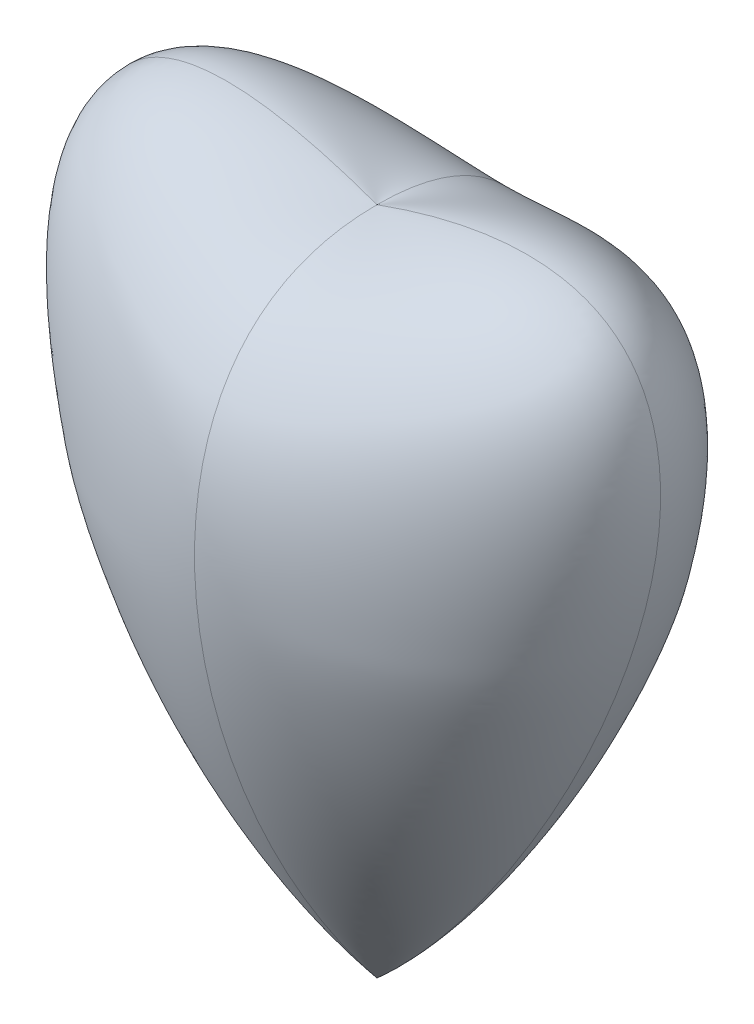
ISO-10303-21;
HEADER;
FILE_DESCRIPTION(('STEP AP214'),'2;1');
FILE_NAME('part.step','',(''),(''),'','','');
FILE_SCHEMA(('AUTOMOTIVE_DESIGN { 1 0 10303 214 1 1 1 1 }'));
ENDSEC;
DATA;
#1=APPLICATION_CONTEXT('core data for automotive mechanical design processes');
#2=APPLICATION_PROTOCOL_DEFINITION('international standard','automotive_design',2000,#1);
#3=PRODUCT_CONTEXT('',#1,'mechanical');
#4=PRODUCT('Part','Part','',(#3));
#5=PRODUCT_RELATED_PRODUCT_CATEGORY('part','',(#4));
#6=PRODUCT_DEFINITION_FORMATION('','',#4);
#7=PRODUCT_DEFINITION_CONTEXT('part definition',#1,'design');
#8=PRODUCT_DEFINITION('design','',#6,#7);
#9=PRODUCT_DEFINITION_SHAPE('','',#8);
#10=(LENGTH_UNIT() NAMED_UNIT(*) SI_UNIT(.MILLI.,.METRE.));
#11=(NAMED_UNIT(*) PLANE_ANGLE_UNIT() SI_UNIT($,.RADIAN.));
#12=(NAMED_UNIT(*) SI_UNIT($,.STERADIAN.) SOLID_ANGLE_UNIT());
#13=UNCERTAINTY_MEASURE_WITH_UNIT(LENGTH_MEASURE(1.E-05),#10,'distance_accuracy_value','');
#14=(GEOMETRIC_REPRESENTATION_CONTEXT(3) GLOBAL_UNCERTAINTY_ASSIGNED_CONTEXT((#13)) GLOBAL_UNIT_ASSIGNED_CONTEXT((#10,
#11,#12)) REPRESENTATION_CONTEXT('',''));
#15=CARTESIAN_POINT('',(0.,0.,0.));
#16=DIRECTION('',(0.,0.,1.));
#17=DIRECTION('',(1.,0.,0.));
#18=AXIS2_PLACEMENT_3D('',#15,#16,#17);
#19=CARTESIAN_POINT('',(0.,-46.6213268032057,0.));
#20=CARTESIAN_POINT('',(0.,-46.6213268032057,0.));
#21=CARTESIAN_POINT('',(0.,-46.6213268032057,0.));
#22=CARTESIAN_POINT('',(0.,-46.6213268032057,0.));
#23=CARTESIAN_POINT('',(1.13051228827783,-45.6225779628254,0.));
#24=CARTESIAN_POINT('',(1.13051228827783,-45.6225779628254,0.445300611491787));
#25=CARTESIAN_POINT('',(0.445300611491787,-45.6739537178196,0.759127937524415));
#26=CARTESIAN_POINT('',(0.,-45.6739537178196,0.759127937524415));
#27=CARTESIAN_POINT('',(3.28623084838856,-43.5741127770957,0.));
#28=CARTESIAN_POINT('',(3.28623084838856,-43.5741127770957,1.34262849043695));
#29=CARTESIAN_POINT('',(1.34685428148095,-43.7322109616794,2.26765167337983));
#30=CARTESIAN_POINT('',(0.,-43.7322109616794,2.26765167337983));
#31=CARTESIAN_POINT('',(7.26857467412762,-39.3532222788361,0.));
#32=CARTESIAN_POINT('',(7.26857467412762,-39.3532222788361,3.02819689009236));
#33=CARTESIAN_POINT('',(3.05566453187834,-39.6686813992152,5.23136881524727));
#34=CARTESIAN_POINT('',(0.,-39.6686813992152,5.23136881524727));
#35=CARTESIAN_POINT('',(11.7602720992127,-33.9273230291898,0.));
#36=CARTESIAN_POINT('',(11.7602720992127,-33.9273230291898,5.02722208234695));
#37=CARTESIAN_POINT('',(5.10751211218288,-34.2665786482051,8.80901754961998));
#38=CARTESIAN_POINT('',(0.,-34.2665786482051,8.80901754961998));
#39=CARTESIAN_POINT('',(16.6080014395491,-27.2559865047789,0.));
#40=CARTESIAN_POINT('',(16.6080014395491,-27.2559865047789,7.26031911611085));
#41=CARTESIAN_POINT('',(7.42935075787071,-27.3154038180331,12.8125890837119));
#42=CARTESIAN_POINT('',(0.,-27.3154038180331,12.8125890837119));
#43=CARTESIAN_POINT('',(21.0407136372392,-20.4165369106544,0.));
#44=CARTESIAN_POINT('',(21.0407136372392,-20.4165369106544,9.32830134519519));
#45=CARTESIAN_POINT('',(9.59875197201096,-20.0165363483266,16.4228537572866));
#46=CARTESIAN_POINT('',(0.,-20.0165363483266,16.4228537572866));
#47=CARTESIAN_POINT('',(25.1325041453014,-13.3682859505047,0.));
#48=CARTESIAN_POINT('',(25.1325041453014,-13.3682859505047,11.2065944436326));
#49=CARTESIAN_POINT('',(11.5784640555043,-12.490935128511,19.536111656982));
#50=CARTESIAN_POINT('',(0.,-12.490935128511,19.536111656982));
#51=CARTESIAN_POINT('',(28.918824266872,-6.04281742376062,0.));
#52=CARTESIAN_POINT('',(28.918824266872,-6.04281742376062,12.8662587595553));
#53=CARTESIAN_POINT('',(13.3268699833509,-4.88202235903342,22.0747674831028));
#54=CARTESIAN_POINT('',(0.,-4.88202235903342,22.0747674831028));
#55=CARTESIAN_POINT('',(32.3967898696893,1.6585988547866,0.));
#56=CARTESIAN_POINT('',(32.3967898696893,1.6585988547866,14.2688049747289));
#57=CARTESIAN_POINT('',(14.7928030641844,2.66677975965915,23.9612259359541));
#58=CARTESIAN_POINT('',(0.,2.66677975965915,23.961225935954));
#59=CARTESIAN_POINT('',(34.4767021348691,7.1376434806994,0.));
#60=CARTESIAN_POINT('',(34.4729323001451,7.12632652432667,15.1620250218121));
#61=CARTESIAN_POINT('',(15.7028164113161,7.57180365629506,24.7447792845832));
#62=CARTESIAN_POINT('',(0.,7.58651434532157,24.7463948138781));
#63=CARTESIAN_POINT('',(35.8865107391704,11.369856105553,0.));
#64=CARTESIAN_POINT('',(35.8859119851968,11.3680586599363,15.3912840861341));
#65=CARTESIAN_POINT('',(15.932032726006,11.1527807319344,25.1380421304358));
#66=CARTESIAN_POINT('',(0.,11.1551118235425,25.1382981316667));
#67=CARTESIAN_POINT('',(36.7563451676475,14.1597012970804,0.));
#68=CARTESIAN_POINT('',(36.7563451676475,14.1597012970804,15.3269022384799));
#69=CARTESIAN_POINT('',(15.8635777010674,13.4318837718768,25.3326385445471));
#70=CARTESIAN_POINT('',(0.,13.4318837718768,25.3326385445471));
#71=CARTESIAN_POINT('',(37.8915626574449,18.4934691596049,0.));
#72=CARTESIAN_POINT('',(37.8915626574449,18.4934691596049,15.352054351209));
#73=CARTESIAN_POINT('',(15.8712984257401,16.7607770834714,25.441907716394));
#74=CARTESIAN_POINT('',(0.,16.7607770834714,25.441907716394));
#75=CARTESIAN_POINT('',(38.7996730624471,22.9715185475658,0.));
#76=CARTESIAN_POINT('',(38.7996730624471,22.9715185475658,15.368815432418));
#77=CARTESIAN_POINT('',(15.8611200890436,20.0174962702014,25.364798926273));
#78=CARTESIAN_POINT('',(0.,20.0174962702014,25.364798926273));
#79=CARTESIAN_POINT('',(39.4007405496589,27.5811529142721,0.));
#80=CARTESIAN_POINT('',(39.4007405496589,27.5811529142721,15.3491424267882));
#81=CARTESIAN_POINT('',(15.8065843073008,23.2032737512452,25.0854861494432));
#82=CARTESIAN_POINT('',(0.,23.2032737512452,25.0854861494432));
#83=CARTESIAN_POINT('',(39.5748859108984,32.2959609266022,0.));
#84=CARTESIAN_POINT('',(39.5748859108984,32.2959609266022,15.2540245075061));
#85=CARTESIAN_POINT('',(15.6702649253398,26.3193419457811,24.5881433611637));
#86=CARTESIAN_POINT('',(0.,26.3193419457811,24.5881433611637));
#87=CARTESIAN_POINT('',(39.1445568883385,37.0518589042345,0.));
#88=CARTESIAN_POINT('',(39.1445568883385,37.0518589042345,15.0254004740772));
#89=CARTESIAN_POINT('',(15.3956854143074,29.3517776528513,23.8452139460691));
#90=CARTESIAN_POINT('',(0.,29.3517776528513,23.8452139460691));
#91=CARTESIAN_POINT('',(38.0538675540167,40.924815303396,0.));
#92=CARTESIAN_POINT('',(38.0538675540167,40.924815303396,14.6489029680226));
#93=CARTESIAN_POINT('',(14.978250557514,31.7975110017232,22.9984867316731));
#94=CARTESIAN_POINT('',(0.,31.7975110017232,22.9984867316731));
#95=CARTESIAN_POINT('',(36.579037312096,43.7860812422909,0.));
#96=CARTESIAN_POINT('',(36.579037312096,43.7860812422909,14.1751160450414));
#97=CARTESIAN_POINT('',(14.4709214181212,33.6848624301592,22.1687820601869));
#98=CARTESIAN_POINT('',(0.,33.6848624301592,22.1687820601869));
#99=CARTESIAN_POINT('',(35.1509853813602,45.73385414719,0.));
#100=CARTESIAN_POINT('',(35.1509853813602,45.73385414719,13.7200020043031));
#101=CARTESIAN_POINT('',(13.9904526311189,35.0606440245429,21.4664042868678));
#102=CARTESIAN_POINT('',(0.,35.0606440245429,21.4664042868678));
#103=CARTESIAN_POINT('',(33.4099304398918,47.4117757064586,0.));
#104=CARTESIAN_POINT('',(33.4099304398918,47.4117757064586,13.159218638388));
#105=CARTESIAN_POINT('',(13.4043145189398,36.3915792903708,20.6799894241243));
#106=CARTESIAN_POINT('',(0.,36.3915792903708,20.6799894241243));
#107=CARTESIAN_POINT('',(31.4084561208772,48.7617276088435,0.));
#108=CARTESIAN_POINT('',(31.4084561208772,48.7617276088435,12.4993891955368));
#109=CARTESIAN_POINT('',(12.7193284137798,37.66948180394,19.8076121886582));
#110=CARTESIAN_POINT('',(0.,37.66948180394,19.8076121886582));
#111=CARTESIAN_POINT('',(29.2223694537122,49.7720483488829,0.));
#112=CARTESIAN_POINT('',(29.2223694537122,49.7720483488829,11.7570826935748));
#113=CARTESIAN_POINT('',(11.9522614174194,38.8861651415474,18.8473472971709));
#114=CARTESIAN_POINT('',(0.,38.8861651415474,18.8473472971709));
#115=CARTESIAN_POINT('',(26.9251259176925,50.465363387162,0.));
#116=CARTESIAN_POINT('',(26.9251259176925,50.465363387162,10.9521674747066));
#117=CARTESIAN_POINT('',(11.1231799560183,40.0329496565182,17.7996458920486));
#118=CARTESIAN_POINT('',(0.,40.0329496565182,17.7996458920486));
#119=CARTESIAN_POINT('',(24.5735752192804,50.8855809181493,0.));
#120=CARTESIAN_POINT('',(24.5735752192804,50.8855809181493,10.1027219238561));
#121=CARTESIAN_POINT('',(10.2503604984557,41.1011557021776,16.6649591156769));
#122=CARTESIAN_POINT('',(0.,41.1011557021776,16.6649591156769));
#123=CARTESIAN_POINT('',(21.4135208527332,51.1399537433875,0.));
#124=CARTESIAN_POINT('',(21.4135208527332,51.1399537433875,8.92857906078101));
#125=CARTESIAN_POINT('',(9.04637298613242,42.412408503355,15.041445672229));
#126=CARTESIAN_POINT('',(0.,42.412408503355,15.041445672229));
#127=CARTESIAN_POINT('',(17.481898288781,50.9930857074177,0.));
#128=CARTESIAN_POINT('',(17.481898288781,50.9930857074177,7.41066442694201));
#129=CARTESIAN_POINT('',(7.49412380006094,43.8240884542237,12.8147757649711));
#130=CARTESIAN_POINT('',(0.,43.8240884542237,12.8147757649711));
#131=CARTESIAN_POINT('',(12.8814270936918,50.3195650057034,0.));
#132=CARTESIAN_POINT('',(12.8814270936918,50.3195650057034,5.56064358702089));
#133=CARTESIAN_POINT('',(5.60924018402686,45.1113405998043,9.88184687534541));
#134=CARTESIAN_POINT('',(0.,45.1113405998043,9.88184687534541));
#135=CARTESIAN_POINT('',(8.42562762291368,49.3058744139121,0.));
#136=CARTESIAN_POINT('',(8.42562762291368,49.3058744139121,3.70437901848294));
#137=CARTESIAN_POINT('',(3.72603619758343,46.0041400273576,6.74161412407392));
#138=CARTESIAN_POINT('',(0.,46.0041400273576,6.74161412407392));
#139=CARTESIAN_POINT('',(4.12350774377605,48.0560797063807,0.));
#140=CARTESIAN_POINT('',(4.12350774377605,48.0560797063807,1.85041964695783));
#141=CARTESIAN_POINT('',(1.85464543800183,46.5147978143178,3.44769865042711));
#142=CARTESIAN_POINT('',(0.,46.5147978143178,3.44769865042711));
#143=CARTESIAN_POINT('',(1.35776800822028,47.1124458616088,0.));
#144=CARTESIAN_POINT('',(1.35776800822028,47.1124458616088,0.620750878771898));
#145=CARTESIAN_POINT('',(0.620750878771897,46.6213268032057,1.1620565194078));
#146=CARTESIAN_POINT('',(0.,46.6213268032057,1.1620565194078));
#147=CARTESIAN_POINT('',(0.,46.6213268032057,0.));
#148=CARTESIAN_POINT('',(0.,46.6213268032057,0.));
#149=CARTESIAN_POINT('',(0.,46.6213268032057,0.));
#150=CARTESIAN_POINT('',(0.,46.6213268032057,0.));
#151=B_SPLINE_SURFACE_WITH_KNOTS('',3,3,((#19,#20,#21,#22),(#23,#24,#25,#26),(#27,#28,#29,#30),
(#31,#32,#33,#34),(#35,#36,#37,#38),(#39,#40,#41,#42),(#43,#44,#45,#46),(#47,#48,#49,#50),(#51,
#52,#53,#54),(#55,#56,#57,#58),(#59,#60,#61,#62),(#63,#64,#65,#66),(#67,#68,#69,#70),(#71,#72,
#73,#74),(#75,#76,#77,#78),(#79,#80,#81,#82),(#83,#84,#85,#86),(#87,#88,#89,#90),(#91,#92,#93,
#94),(#95,#96,#97,#98),(#99,#100,#101,#102),(#103,#104,#105,#106),(#107,#108,#109,#110),(#111,
#112,#113,#114),(#115,#116,#117,#118),(#119,#120,#121,#122),(#123,#124,#125,#126),(#127,#128,
#129,#130),(#131,#132,#133,#134),(#135,#136,#137,#138),(#139,#140,#141,#142),(#143,#144,#145,
#146),(#147,#148,#149,#150)),.UNSPECIFIED.,.F.,.F.,.F.,(4,1,1,1,1,1,1,1,1,2,1,1,1,1,1,1,1,1,1,1,
1,1,1,1,1,1,1,1,1,4),(4,4),(0.,0.0319331403142546,0.0638662806285092,0.127732561257018,
0.191598841885528,0.255465122514037,0.319331403142546,0.383197683771055,0.447063964399565,
0.510930245028074,0.541497104713819,0.572063964399564,0.60263082408531,0.633197683771055,
0.663764543456801,0.694331403142546,0.724898262828291,0.740181692671164,0.755465122514037,
0.77074855235691,0.786031982199782,0.801315412042655,0.816598841885528,0.8318822717284,
0.847165701571273,0.877732561257018,0.908299420942764,0.938866280628509,0.969433140314255,1.),
(0.,1.),.UNSPECIFIED.);
#152=CARTESIAN_POINT('',(0.,-46.6213268032057,0.));
#153=CARTESIAN_POINT('',(31.3377814309968,-18.9360259101238,0.));
#154=CARTESIAN_POINT('',(70.446601168176,72.1026080117432,0.));
#155=CARTESIAN_POINT('',(0.,46.6213268032057,0.));
#156=B_SPLINE_CURVE_WITH_KNOTS('',3,(#152,#153,#154,#155),.UNSPECIFIED.,.F.,.F.,(4,4),(0.,1.),.UNSPECIFIED.);
#157=CARTESIAN_POINT('',(0.,-46.6213268032057,0.));
#158=VERTEX_POINT('',#157);
#159=CARTESIAN_POINT('',(0.,46.6213268032057,0.));
#160=VERTEX_POINT('',#159);
#161=EDGE_CURVE('E91',#158,#160,#156,.T.);
#162=CARTESIAN_POINT('',(0.,46.6213268032057,0.));
#163=CARTESIAN_POINT('',(0.,46.6213268032057,37.3767464824983));
#164=CARTESIAN_POINT('',(0.,-8.93486853865014,30.1980748411409));
#165=CARTESIAN_POINT('',(0.,-46.6213268032057,0.));
#166=B_SPLINE_CURVE_WITH_KNOTS('',3,(#162,#163,#164,#165),.UNSPECIFIED.,.F.,.F.,(4,4),(0.,1.),.UNSPECIFIED.);
#167=EDGE_CURVE('E13',#160,#158,#166,.T.);
#168=ORIENTED_EDGE('',*,*,#161,.T.);
#169=ORIENTED_EDGE('',*,*,#167,.T.);
#170=EDGE_LOOP('',(#168,#169));
#171=FACE_BOUND('',#170,.T.);
#172=ADVANCED_FACE('F85',(#171),#151,.T.);
#173=CARTESIAN_POINT('',(0.,-46.6213268032057,0.));
#174=CARTESIAN_POINT('',(0.,-46.6213268032057,0.));
#175=CARTESIAN_POINT('',(0.,-46.6213268032057,0.));
#176=CARTESIAN_POINT('',(0.,-46.6213268032057,0.));
#177=CARTESIAN_POINT('',(-1.13051228827783,-45.6225779628254,0.));
#178=CARTESIAN_POINT('',(-1.13051228827783,-45.6225779628254,0.445300611491787));
#179=CARTESIAN_POINT('',(-0.445300611491787,-45.6739537178196,0.759127937524415));
#180=CARTESIAN_POINT('',(0.,-45.6739537178196,0.759127937524415));
#181=CARTESIAN_POINT('',(-3.28623084838856,-43.5741127770957,0.));
#182=CARTESIAN_POINT('',(-3.28623084838856,-43.5741127770957,1.34262849043695));
#183=CARTESIAN_POINT('',(-1.34685428148095,-43.7322109616794,2.26765167337983));
#184=CARTESIAN_POINT('',(0.,-43.7322109616794,2.26765167337983));
#185=CARTESIAN_POINT('',(-7.26857467412762,-39.3532222788361,0.));
#186=CARTESIAN_POINT('',(-7.26857467412762,-39.3532222788361,3.02819689009236));
#187=CARTESIAN_POINT('',(-3.05566453187834,-39.6686813992152,5.23136881524727));
#188=CARTESIAN_POINT('',(0.,-39.6686813992152,5.23136881524727));
#189=CARTESIAN_POINT('',(-11.7602720992127,-33.9273230291898,0.));
#190=CARTESIAN_POINT('',(-11.7602720992127,-33.9273230291898,5.02722208234695));
#191=CARTESIAN_POINT('',(-5.10751211218288,-34.2665786482051,8.80901754961998));
#192=CARTESIAN_POINT('',(0.,-34.2665786482051,8.80901754961998));
#193=CARTESIAN_POINT('',(-16.6080014395491,-27.2559865047789,0.));
#194=CARTESIAN_POINT('',(-16.6080014395491,-27.2559865047789,7.26031911611085));
#195=CARTESIAN_POINT('',(-7.42935075787071,-27.3154038180331,12.8125890837119));
#196=CARTESIAN_POINT('',(0.,-27.3154038180331,12.8125890837119));
#197=CARTESIAN_POINT('',(-21.0407136372392,-20.4165369106544,0.));
#198=CARTESIAN_POINT('',(-21.0407136372392,-20.4165369106544,9.32830134519519));
#199=CARTESIAN_POINT('',(-9.59875197201096,-20.0165363483266,16.4228537572866));
#200=CARTESIAN_POINT('',(0.,-20.0165363483266,16.4228537572866));
#201=CARTESIAN_POINT('',(-25.1325041453014,-13.3682859505047,0.));
#202=CARTESIAN_POINT('',(-25.1325041453014,-13.3682859505047,11.2065944436326));
#203=CARTESIAN_POINT('',(-11.5784640555043,-12.490935128511,19.536111656982));
#204=CARTESIAN_POINT('',(0.,-12.490935128511,19.536111656982));
#205=CARTESIAN_POINT('',(-28.918824266872,-6.04281742376062,0.));
#206=CARTESIAN_POINT('',(-28.918824266872,-6.04281742376062,12.8662587595553));
#207=CARTESIAN_POINT('',(-13.3268699833509,-4.88202235903342,22.0747674831028));
#208=CARTESIAN_POINT('',(0.,-4.88202235903342,22.0747674831028));
#209=CARTESIAN_POINT('',(-32.3967898696893,1.6585988547866,0.));
#210=CARTESIAN_POINT('',(-32.3967898696893,1.6585988547866,14.2688049747289));
#211=CARTESIAN_POINT('',(-14.7928030641844,2.66677975965915,23.9612259359541));
#212=CARTESIAN_POINT('',(0.,2.66677975965915,23.961225935954));
#213=CARTESIAN_POINT('',(-34.4767021348691,7.1376434806994,0.));
#214=CARTESIAN_POINT('',(-34.4729323001451,7.12632652432667,15.1620250218121));
#215=CARTESIAN_POINT('',(-15.7028164113161,7.57180365629506,24.7447792845832));
#216=CARTESIAN_POINT('',(0.,7.58651434532157,24.7463948138781));
#217=CARTESIAN_POINT('',(-35.8865107391704,11.369856105553,0.));
#218=CARTESIAN_POINT('',(-35.8859119851968,11.3680586599363,15.3912840861341));
#219=CARTESIAN_POINT('',(-15.932032726006,11.1527807319344,25.1380421304358));
#220=CARTESIAN_POINT('',(0.,11.1551118235425,25.1382981316667));
#221=CARTESIAN_POINT('',(-36.7563451676475,14.1597012970804,0.));
#222=CARTESIAN_POINT('',(-36.7563451676475,14.1597012970804,15.3269022384799));
#223=CARTESIAN_POINT('',(-15.8635777010674,13.4318837718768,25.3326385445471));
#224=CARTESIAN_POINT('',(0.,13.4318837718768,25.3326385445471));
#225=CARTESIAN_POINT('',(-37.8915626574449,18.4934691596049,0.));
#226=CARTESIAN_POINT('',(-37.8915626574449,18.4934691596049,15.352054351209));
#227=CARTESIAN_POINT('',(-15.8712984257401,16.7607770834714,25.441907716394));
#228=CARTESIAN_POINT('',(0.,16.7607770834714,25.441907716394));
#229=CARTESIAN_POINT('',(-38.7996730624471,22.9715185475658,0.));
#230=CARTESIAN_POINT('',(-38.7996730624471,22.9715185475658,15.368815432418));
#231=CARTESIAN_POINT('',(-15.8611200890436,20.0174962702014,25.364798926273));
#232=CARTESIAN_POINT('',(0.,20.0174962702014,25.364798926273));
#233=CARTESIAN_POINT('',(-39.4007405496589,27.5811529142721,0.));
#234=CARTESIAN_POINT('',(-39.4007405496589,27.5811529142721,15.3491424267882));
#235=CARTESIAN_POINT('',(-15.8065843073008,23.2032737512452,25.0854861494432));
#236=CARTESIAN_POINT('',(0.,23.2032737512452,25.0854861494432));
#237=CARTESIAN_POINT('',(-39.5748859108984,32.2959609266022,0.));
#238=CARTESIAN_POINT('',(-39.5748859108984,32.2959609266022,15.2540245075061));
#239=CARTESIAN_POINT('',(-15.6702649253398,26.3193419457811,24.5881433611637));
#240=CARTESIAN_POINT('',(0.,26.3193419457811,24.5881433611637));
#241=CARTESIAN_POINT('',(-39.1445568883385,37.0518589042345,0.));
#242=CARTESIAN_POINT('',(-39.1445568883385,37.0518589042345,15.0254004740772));
#243=CARTESIAN_POINT('',(-15.3956854143074,29.3517776528513,23.8452139460691));
#244=CARTESIAN_POINT('',(0.,29.3517776528513,23.8452139460691));
#245=CARTESIAN_POINT('',(-38.0538675540167,40.924815303396,0.));
#246=CARTESIAN_POINT('',(-38.0538675540167,40.924815303396,14.6489029680226));
#247=CARTESIAN_POINT('',(-14.978250557514,31.7975110017232,22.9984867316731));
#248=CARTESIAN_POINT('',(0.,31.7975110017232,22.9984867316731));
#249=CARTESIAN_POINT('',(-36.579037312096,43.7860812422909,0.));
#250=CARTESIAN_POINT('',(-36.579037312096,43.7860812422909,14.1751160450414));
#251=CARTESIAN_POINT('',(-14.4709214181212,33.6848624301592,22.1687820601869));
#252=CARTESIAN_POINT('',(0.,33.6848624301592,22.1687820601869));
#253=CARTESIAN_POINT('',(-35.1509853813602,45.73385414719,0.));
#254=CARTESIAN_POINT('',(-35.1509853813602,45.73385414719,13.7200020043031));
#255=CARTESIAN_POINT('',(-13.9904526311189,35.0606440245429,21.4664042868678));
#256=CARTESIAN_POINT('',(0.,35.0606440245429,21.4664042868678));
#257=CARTESIAN_POINT('',(-33.4099304398918,47.4117757064586,0.));
#258=CARTESIAN_POINT('',(-33.4099304398918,47.4117757064586,13.159218638388));
#259=CARTESIAN_POINT('',(-13.4043145189398,36.3915792903708,20.6799894241243));
#260=CARTESIAN_POINT('',(0.,36.3915792903708,20.6799894241243));
#261=CARTESIAN_POINT('',(-31.4084561208772,48.7617276088435,0.));
#262=CARTESIAN_POINT('',(-31.4084561208772,48.7617276088435,12.4993891955368));
#263=CARTESIAN_POINT('',(-12.7193284137798,37.66948180394,19.8076121886582));
#264=CARTESIAN_POINT('',(0.,37.66948180394,19.8076121886582));
#265=CARTESIAN_POINT('',(-29.2223694537122,49.7720483488829,0.));
#266=CARTESIAN_POINT('',(-29.2223694537122,49.7720483488829,11.7570826935748));
#267=CARTESIAN_POINT('',(-11.9522614174194,38.8861651415474,18.8473472971709));
#268=CARTESIAN_POINT('',(0.,38.8861651415474,18.8473472971709));
#269=CARTESIAN_POINT('',(-26.9251259176925,50.465363387162,0.));
#270=CARTESIAN_POINT('',(-26.9251259176925,50.465363387162,10.9521674747066));
#271=CARTESIAN_POINT('',(-11.1231799560183,40.0329496565182,17.7996458920486));
#272=CARTESIAN_POINT('',(0.,40.0329496565182,17.7996458920486));
#273=CARTESIAN_POINT('',(-24.5735752192804,50.8855809181493,0.));
#274=CARTESIAN_POINT('',(-24.5735752192804,50.8855809181493,10.1027219238561));
#275=CARTESIAN_POINT('',(-10.2503604984557,41.1011557021776,16.6649591156769));
#276=CARTESIAN_POINT('',(0.,41.1011557021776,16.6649591156769));
#277=CARTESIAN_POINT('',(-21.4135208527332,51.1399537433875,0.));
#278=CARTESIAN_POINT('',(-21.4135208527332,51.1399537433875,8.92857906078101));
#279=CARTESIAN_POINT('',(-9.04637298613242,42.412408503355,15.041445672229));
#280=CARTESIAN_POINT('',(0.,42.412408503355,15.041445672229));
#281=CARTESIAN_POINT('',(-17.481898288781,50.9930857074177,0.));
#282=CARTESIAN_POINT('',(-17.481898288781,50.9930857074177,7.41066442694201));
#283=CARTESIAN_POINT('',(-7.49412380006094,43.8240884542237,12.8147757649711));
#284=CARTESIAN_POINT('',(0.,43.8240884542237,12.8147757649711));
#285=CARTESIAN_POINT('',(-12.8814270936918,50.3195650057034,0.));
#286=CARTESIAN_POINT('',(-12.8814270936918,50.3195650057034,5.56064358702089));
#287=CARTESIAN_POINT('',(-5.60924018402686,45.1113405998043,9.88184687534541));
#288=CARTESIAN_POINT('',(0.,45.1113405998043,9.88184687534541));
#289=CARTESIAN_POINT('',(-8.42562762291368,49.3058744139121,0.));
#290=CARTESIAN_POINT('',(-8.42562762291368,49.3058744139121,3.70437901848294));
#291=CARTESIAN_POINT('',(-3.72603619758343,46.0041400273576,6.74161412407392));
#292=CARTESIAN_POINT('',(0.,46.0041400273576,6.74161412407392));
#293=CARTESIAN_POINT('',(-4.12350774377605,48.0560797063807,0.));
#294=CARTESIAN_POINT('',(-4.12350774377605,48.0560797063807,1.85041964695783));
#295=CARTESIAN_POINT('',(-1.85464543800183,46.5147978143178,3.44769865042711));
#296=CARTESIAN_POINT('',(0.,46.5147978143178,3.44769865042711));
#297=CARTESIAN_POINT('',(-1.35776800822028,47.1124458616088,0.));
#298=CARTESIAN_POINT('',(-1.35776800822028,47.1124458616088,0.620750878771898));
#299=CARTESIAN_POINT('',(-0.620750878771897,46.6213268032057,1.1620565194078));
#300=CARTESIAN_POINT('',(0.,46.6213268032057,1.1620565194078));
#301=CARTESIAN_POINT('',(0.,46.6213268032057,0.));
#302=CARTESIAN_POINT('',(0.,46.6213268032057,0.));
#303=CARTESIAN_POINT('',(0.,46.6213268032057,0.));
#304=CARTESIAN_POINT('',(0.,46.6213268032057,0.));
#305=B_SPLINE_SURFACE_WITH_KNOTS('',3,3,((#173,#174,#175,#176),(#177,#178,#179,#180),(#181,#182,
#183,#184),(#185,#186,#187,#188),(#189,#190,#191,#192),(#193,#194,#195,#196),(#197,#198,#199,
#200),(#201,#202,#203,#204),(#205,#206,#207,#208),(#209,#210,#211,#212),(#213,#214,#215,#216),
(#217,#218,#219,#220),(#221,#222,#223,#224),(#225,#226,#227,#228),(#229,#230,#231,#232),(#233,
#234,#235,#236),(#237,#238,#239,#240),(#241,#242,#243,#244),(#245,#246,#247,#248),(#249,#250,
#251,#252),(#253,#254,#255,#256),(#257,#258,#259,#260),(#261,#262,#263,#264),(#265,#266,#267,
#268),(#269,#270,#271,#272),(#273,#274,#275,#276),(#277,#278,#279,#280),(#281,#282,#283,#284),
(#285,#286,#287,#288),(#289,#290,#291,#292),(#293,#294,#295,#296),(#297,#298,#299,#300),(#301,
#302,#303,#304)),.UNSPECIFIED.,.F.,.F.,.F.,(4,1,1,1,1,1,1,1,1,2,1,1,1,1,1,1,1,1,1,1,1,1,1,1,1,1,
1,1,1,4),(4,4),(0.,0.0319331403142546,0.0638662806285092,0.127732561257018,0.191598841885528,
0.255465122514037,0.319331403142546,0.383197683771055,0.447063964399565,0.510930245028074,
0.541497104713819,0.572063964399564,0.60263082408531,0.633197683771055,0.663764543456801,
0.694331403142546,0.724898262828291,0.740181692671164,0.755465122514037,0.77074855235691,
0.786031982199782,0.801315412042655,0.816598841885528,0.8318822717284,0.847165701571273,
0.877732561257018,0.908299420942764,0.938866280628509,0.969433140314255,1.),(0.,1.),.UNSPECIFIED.);
#306=CARTESIAN_POINT('',(0.,-46.6213268032057,0.));
#307=CARTESIAN_POINT('',(-31.3377814309968,-18.9360259101238,0.));
#308=CARTESIAN_POINT('',(-70.446601168176,72.1026080117432,0.));
#309=CARTESIAN_POINT('',(0.,46.6213268032057,0.));
#310=B_SPLINE_CURVE_WITH_KNOTS('',3,(#306,#307,#308,#309),.UNSPECIFIED.,.F.,.F.,(4,4),(0.,1.),.UNSPECIFIED.);
#311=EDGE_CURVE('E103',#158,#160,#310,.T.);
#312=ORIENTED_EDGE('',*,*,#311,.F.);
#313=ORIENTED_EDGE('',*,*,#167,.F.);
#314=EDGE_LOOP('',(#312,#313));
#315=FACE_BOUND('',#314,.T.);
#316=ADVANCED_FACE('F117',(#315),#305,.F.);
#317=CARTESIAN_POINT('',(0.,-46.6213268032057,0.));
#318=CARTESIAN_POINT('',(0.,-46.6213268032057,0.));
#319=CARTESIAN_POINT('',(0.,-46.6213268032057,0.));
#320=CARTESIAN_POINT('',(0.,-46.6213268032057,0.));
#321=CARTESIAN_POINT('',(1.13051228827783,-45.6225779628254,0.));
#322=CARTESIAN_POINT('',(1.13051228827783,-45.6225779628254,-0.445300611491787));
#323=CARTESIAN_POINT('',(0.445300611491787,-45.6739537178196,-0.759127937524415));
#324=CARTESIAN_POINT('',(0.,-45.6739537178196,-0.759127937524415));
#325=CARTESIAN_POINT('',(3.28623084838856,-43.5741127770957,0.));
#326=CARTESIAN_POINT('',(3.28623084838856,-43.5741127770957,-1.34262849043695));
#327=CARTESIAN_POINT('',(1.34685428148095,-43.7322109616794,-2.26765167337983));
#328=CARTESIAN_POINT('',(0.,-43.7322109616794,-2.26765167337983));
#329=CARTESIAN_POINT('',(7.26857467412762,-39.3532222788361,0.));
#330=CARTESIAN_POINT('',(7.26857467412762,-39.3532222788361,-3.02819689009236));
#331=CARTESIAN_POINT('',(3.05566453187834,-39.6686813992152,-5.23136881524727));
#332=CARTESIAN_POINT('',(0.,-39.6686813992152,-5.23136881524727));
#333=CARTESIAN_POINT('',(11.7602720992127,-33.9273230291898,0.));
#334=CARTESIAN_POINT('',(11.7602720992127,-33.9273230291898,-5.02722208234695));
#335=CARTESIAN_POINT('',(5.10751211218288,-34.2665786482051,-8.80901754961998));
#336=CARTESIAN_POINT('',(0.,-34.2665786482051,-8.80901754961998));
#337=CARTESIAN_POINT('',(16.6080014395491,-27.2559865047789,0.));
#338=CARTESIAN_POINT('',(16.6080014395491,-27.2559865047789,-7.26031911611085));
#339=CARTESIAN_POINT('',(7.42935075787071,-27.3154038180331,-12.8125890837119));
#340=CARTESIAN_POINT('',(0.,-27.3154038180331,-12.8125890837119));
#341=CARTESIAN_POINT('',(21.0407136372392,-20.4165369106544,0.));
#342=CARTESIAN_POINT('',(21.0407136372392,-20.4165369106544,-9.32830134519519));
#343=CARTESIAN_POINT('',(9.59875197201096,-20.0165363483266,-16.4228537572866));
#344=CARTESIAN_POINT('',(0.,-20.0165363483266,-16.4228537572866));
#345=CARTESIAN_POINT('',(25.1325041453014,-13.3682859505047,0.));
#346=CARTESIAN_POINT('',(25.1325041453014,-13.3682859505047,-11.2065944436326));
#347=CARTESIAN_POINT('',(11.5784640555043,-12.490935128511,-19.536111656982));
#348=CARTESIAN_POINT('',(0.,-12.490935128511,-19.536111656982));
#349=CARTESIAN_POINT('',(28.918824266872,-6.04281742376062,0.));
#350=CARTESIAN_POINT('',(28.918824266872,-6.04281742376062,-12.8662587595553));
#351=CARTESIAN_POINT('',(13.3268699833509,-4.88202235903342,-22.0747674831028));
#352=CARTESIAN_POINT('',(0.,-4.88202235903342,-22.0747674831028));
#353=CARTESIAN_POINT('',(32.3967898696893,1.6585988547866,0.));
#354=CARTESIAN_POINT('',(32.3967898696893,1.6585988547866,-14.2688049747289));
#355=CARTESIAN_POINT('',(14.7928030641844,2.66677975965915,-23.9612259359541));
#356=CARTESIAN_POINT('',(0.,2.66677975965915,-23.961225935954));
#357=CARTESIAN_POINT('',(34.4767021348691,7.1376434806994,0.));
#358=CARTESIAN_POINT('',(34.4729323001451,7.12632652432667,-15.1620250218121));
#359=CARTESIAN_POINT('',(15.7028164113161,7.57180365629506,-24.7447792845832));
#360=CARTESIAN_POINT('',(0.,7.58651434532157,-24.7463948138781));
#361=CARTESIAN_POINT('',(35.8865107391704,11.369856105553,0.));
#362=CARTESIAN_POINT('',(35.8859119851968,11.3680586599363,-15.3912840861341));
#363=CARTESIAN_POINT('',(15.932032726006,11.1527807319344,-25.1380421304358));
#364=CARTESIAN_POINT('',(0.,11.1551118235425,-25.1382981316667));
#365=CARTESIAN_POINT('',(36.7563451676475,14.1597012970804,0.));
#366=CARTESIAN_POINT('',(36.7563451676475,14.1597012970804,-15.3269022384799));
#367=CARTESIAN_POINT('',(15.8635777010674,13.4318837718768,-25.3326385445471));
#368=CARTESIAN_POINT('',(0.,13.4318837718768,-25.3326385445471));
#369=CARTESIAN_POINT('',(37.8915626574449,18.4934691596049,0.));
#370=CARTESIAN_POINT('',(37.8915626574449,18.4934691596049,-15.352054351209));
#371=CARTESIAN_POINT('',(15.8712984257401,16.7607770834714,-25.441907716394));
#372=CARTESIAN_POINT('',(0.,16.7607770834714,-25.441907716394));
#373=CARTESIAN_POINT('',(38.7996730624471,22.9715185475658,0.));
#374=CARTESIAN_POINT('',(38.7996730624471,22.9715185475658,-15.368815432418));
#375=CARTESIAN_POINT('',(15.8611200890436,20.0174962702014,-25.364798926273));
#376=CARTESIAN_POINT('',(0.,20.0174962702014,-25.364798926273));
#377=CARTESIAN_POINT('',(39.4007405496589,27.5811529142721,0.));
#378=CARTESIAN_POINT('',(39.4007405496589,27.5811529142721,-15.3491424267882));
#379=CARTESIAN_POINT('',(15.8065843073008,23.2032737512452,-25.0854861494432));
#380=CARTESIAN_POINT('',(0.,23.2032737512452,-25.0854861494432));
#381=CARTESIAN_POINT('',(39.5748859108984,32.2959609266022,0.));
#382=CARTESIAN_POINT('',(39.5748859108984,32.2959609266022,-15.2540245075061));
#383=CARTESIAN_POINT('',(15.6702649253398,26.3193419457811,-24.5881433611637));
#384=CARTESIAN_POINT('',(0.,26.3193419457811,-24.5881433611637));
#385=CARTESIAN_POINT('',(39.1445568883385,37.0518589042345,0.));
#386=CARTESIAN_POINT('',(39.1445568883385,37.0518589042345,-15.0254004740772));
#387=CARTESIAN_POINT('',(15.3956854143074,29.3517776528513,-23.8452139460691));
#388=CARTESIAN_POINT('',(0.,29.3517776528513,-23.8452139460691));
#389=CARTESIAN_POINT('',(38.0538675540167,40.924815303396,0.));
#390=CARTESIAN_POINT('',(38.0538675540167,40.924815303396,-14.6489029680226));
#391=CARTESIAN_POINT('',(14.978250557514,31.7975110017232,-22.9984867316731));
#392=CARTESIAN_POINT('',(0.,31.7975110017232,-22.9984867316731));
#393=CARTESIAN_POINT('',(36.579037312096,43.7860812422909,0.));
#394=CARTESIAN_POINT('',(36.579037312096,43.7860812422909,-14.1751160450414));
#395=CARTESIAN_POINT('',(14.4709214181212,33.6848624301592,-22.1687820601869));
#396=CARTESIAN_POINT('',(0.,33.6848624301592,-22.1687820601869));
#397=CARTESIAN_POINT('',(35.1509853813602,45.73385414719,0.));
#398=CARTESIAN_POINT('',(35.1509853813602,45.73385414719,-13.7200020043031));
#399=CARTESIAN_POINT('',(13.9904526311189,35.0606440245429,-21.4664042868678));
#400=CARTESIAN_POINT('',(0.,35.0606440245429,-21.4664042868678));
#401=CARTESIAN_POINT('',(33.4099304398918,47.4117757064586,0.));
#402=CARTESIAN_POINT('',(33.4099304398918,47.4117757064586,-13.159218638388));
#403=CARTESIAN_POINT('',(13.4043145189398,36.3915792903708,-20.6799894241243));
#404=CARTESIAN_POINT('',(0.,36.3915792903708,-20.6799894241243));
#405=CARTESIAN_POINT('',(31.4084561208772,48.7617276088435,0.));
#406=CARTESIAN_POINT('',(31.4084561208772,48.7617276088435,-12.4993891955368));
#407=CARTESIAN_POINT('',(12.7193284137798,37.66948180394,-19.8076121886582));
#408=CARTESIAN_POINT('',(0.,37.66948180394,-19.8076121886582));
#409=CARTESIAN_POINT('',(29.2223694537122,49.7720483488829,0.));
#410=CARTESIAN_POINT('',(29.2223694537122,49.7720483488829,-11.7570826935748));
#411=CARTESIAN_POINT('',(11.9522614174194,38.8861651415474,-18.8473472971709));
#412=CARTESIAN_POINT('',(0.,38.8861651415474,-18.8473472971709));
#413=CARTESIAN_POINT('',(26.9251259176925,50.465363387162,0.));
#414=CARTESIAN_POINT('',(26.9251259176925,50.465363387162,-10.9521674747066));
#415=CARTESIAN_POINT('',(11.1231799560183,40.0329496565182,-17.7996458920486));
#416=CARTESIAN_POINT('',(0.,40.0329496565182,-17.7996458920486));
#417=CARTESIAN_POINT('',(24.5735752192804,50.8855809181493,0.));
#418=CARTESIAN_POINT('',(24.5735752192804,50.8855809181493,-10.1027219238561));
#419=CARTESIAN_POINT('',(10.2503604984557,41.1011557021776,-16.6649591156769));
#420=CARTESIAN_POINT('',(0.,41.1011557021776,-16.6649591156769));
#421=CARTESIAN_POINT('',(21.4135208527332,51.1399537433875,0.));
#422=CARTESIAN_POINT('',(21.4135208527332,51.1399537433875,-8.92857906078101));
#423=CARTESIAN_POINT('',(9.04637298613242,42.412408503355,-15.041445672229));
#424=CARTESIAN_POINT('',(0.,42.412408503355,-15.041445672229));
#425=CARTESIAN_POINT('',(17.481898288781,50.9930857074177,0.));
#426=CARTESIAN_POINT('',(17.481898288781,50.9930857074177,-7.41066442694201));
#427=CARTESIAN_POINT('',(7.49412380006094,43.8240884542237,-12.8147757649711));
#428=CARTESIAN_POINT('',(0.,43.8240884542237,-12.8147757649711));
#429=CARTESIAN_POINT('',(12.8814270936918,50.3195650057034,0.));
#430=CARTESIAN_POINT('',(12.8814270936918,50.3195650057034,-5.56064358702089));
#431=CARTESIAN_POINT('',(5.60924018402686,45.1113405998043,-9.88184687534541));
#432=CARTESIAN_POINT('',(0.,45.1113405998043,-9.88184687534541));
#433=CARTESIAN_POINT('',(8.42562762291368,49.3058744139121,0.));
#434=CARTESIAN_POINT('',(8.42562762291368,49.3058744139121,-3.70437901848294));
#435=CARTESIAN_POINT('',(3.72603619758343,46.0041400273576,-6.74161412407392));
#436=CARTESIAN_POINT('',(0.,46.0041400273576,-6.74161412407392));
#437=CARTESIAN_POINT('',(4.12350774377605,48.0560797063807,0.));
#438=CARTESIAN_POINT('',(4.12350774377605,48.0560797063807,-1.85041964695783));
#439=CARTESIAN_POINT('',(1.85464543800183,46.5147978143178,-3.44769865042711));
#440=CARTESIAN_POINT('',(0.,46.5147978143178,-3.44769865042711));
#441=CARTESIAN_POINT('',(1.35776800822028,47.1124458616088,0.));
#442=CARTESIAN_POINT('',(1.35776800822028,47.1124458616088,-0.620750878771898));
#443=CARTESIAN_POINT('',(0.620750878771897,46.6213268032057,-1.1620565194078));
#444=CARTESIAN_POINT('',(0.,46.6213268032057,-1.1620565194078));
#445=CARTESIAN_POINT('',(0.,46.6213268032057,0.));
#446=CARTESIAN_POINT('',(0.,46.6213268032057,0.));
#447=CARTESIAN_POINT('',(0.,46.6213268032057,0.));
#448=CARTESIAN_POINT('',(0.,46.6213268032057,0.));
#449=B_SPLINE_SURFACE_WITH_KNOTS('',3,3,((#317,#318,#319,#320),(#321,#322,#323,#324),(#325,#326,
#327,#328),(#329,#330,#331,#332),(#333,#334,#335,#336),(#337,#338,#339,#340),(#341,#342,#343,
#344),(#345,#346,#347,#348),(#349,#350,#351,#352),(#353,#354,#355,#356),(#357,#358,#359,#360),
(#361,#362,#363,#364),(#365,#366,#367,#368),(#369,#370,#371,#372),(#373,#374,#375,#376),(#377,
#378,#379,#380),(#381,#382,#383,#384),(#385,#386,#387,#388),(#389,#390,#391,#392),(#393,#394,
#395,#396),(#397,#398,#399,#400),(#401,#402,#403,#404),(#405,#406,#407,#408),(#409,#410,#411,
#412),(#413,#414,#415,#416),(#417,#418,#419,#420),(#421,#422,#423,#424),(#425,#426,#427,#428),
(#429,#430,#431,#432),(#433,#434,#435,#436),(#437,#438,#439,#440),(#441,#442,#443,#444),(#445,
#446,#447,#448)),.UNSPECIFIED.,.F.,.F.,.F.,(4,1,1,1,1,1,1,1,1,2,1,1,1,1,1,1,1,1,1,1,1,1,1,1,1,1,
1,1,1,4),(4,4),(0.,0.0319331403142546,0.0638662806285092,0.127732561257018,0.191598841885528,
0.255465122514037,0.319331403142546,0.383197683771055,0.447063964399565,0.510930245028074,
0.541497104713819,0.572063964399564,0.60263082408531,0.633197683771055,0.663764543456801,
0.694331403142546,0.724898262828291,0.740181692671164,0.755465122514037,0.77074855235691,
0.786031982199782,0.801315412042655,0.816598841885528,0.8318822717284,0.847165701571273,
0.877732561257018,0.908299420942764,0.938866280628509,0.969433140314255,1.),(0.,1.),.UNSPECIFIED.);
#450=CARTESIAN_POINT('',(0.,46.6213268032057,0.));
#451=CARTESIAN_POINT('',(0.,46.6213268032057,-37.3767464824983));
#452=CARTESIAN_POINT('',(0.,-8.93486853865014,-30.1980748411409));
#453=CARTESIAN_POINT('',(0.,-46.6213268032057,0.));
#454=B_SPLINE_CURVE_WITH_KNOTS('',3,(#450,#451,#452,#453),.UNSPECIFIED.,.F.,.F.,(4,4),(0.,1.),.UNSPECIFIED.);
#455=EDGE_CURVE('E120',#160,#158,#454,.T.);
#456=ORIENTED_EDGE('',*,*,#161,.F.);
#457=ORIENTED_EDGE('',*,*,#455,.F.);
#458=EDGE_LOOP('',(#456,#457));
#459=FACE_BOUND('',#458,.T.);
#460=ADVANCED_FACE('F122',(#459),#449,.F.);
#461=CARTESIAN_POINT('',(0.,-46.6213268032057,0.));
#462=CARTESIAN_POINT('',(0.,-46.6213268032057,0.));
#463=CARTESIAN_POINT('',(0.,-46.6213268032057,0.));
#464=CARTESIAN_POINT('',(0.,-46.6213268032057,0.));
#465=CARTESIAN_POINT('',(-1.13051228827783,-45.6225779628254,0.));
#466=CARTESIAN_POINT('',(-1.13051228827783,-45.6225779628254,-0.445300611491787));
#467=CARTESIAN_POINT('',(-0.445300611491787,-45.6739537178196,-0.759127937524415));
#468=CARTESIAN_POINT('',(0.,-45.6739537178196,-0.759127937524415));
#469=CARTESIAN_POINT('',(-3.28623084838856,-43.5741127770957,0.));
#470=CARTESIAN_POINT('',(-3.28623084838856,-43.5741127770957,-1.34262849043695));
#471=CARTESIAN_POINT('',(-1.34685428148095,-43.7322109616794,-2.26765167337983));
#472=CARTESIAN_POINT('',(0.,-43.7322109616794,-2.26765167337983));
#473=CARTESIAN_POINT('',(-7.26857467412762,-39.3532222788361,0.));
#474=CARTESIAN_POINT('',(-7.26857467412762,-39.3532222788361,-3.02819689009236));
#475=CARTESIAN_POINT('',(-3.05566453187834,-39.6686813992152,-5.23136881524727));
#476=CARTESIAN_POINT('',(0.,-39.6686813992152,-5.23136881524727));
#477=CARTESIAN_POINT('',(-11.7602720992127,-33.9273230291898,0.));
#478=CARTESIAN_POINT('',(-11.7602720992127,-33.9273230291898,-5.02722208234695));
#479=CARTESIAN_POINT('',(-5.10751211218288,-34.2665786482051,-8.80901754961998));
#480=CARTESIAN_POINT('',(0.,-34.2665786482051,-8.80901754961998));
#481=CARTESIAN_POINT('',(-16.6080014395491,-27.2559865047789,0.));
#482=CARTESIAN_POINT('',(-16.6080014395491,-27.2559865047789,-7.26031911611085));
#483=CARTESIAN_POINT('',(-7.42935075787071,-27.3154038180331,-12.8125890837119));
#484=CARTESIAN_POINT('',(0.,-27.3154038180331,-12.8125890837119));
#485=CARTESIAN_POINT('',(-21.0407136372392,-20.4165369106544,0.));
#486=CARTESIAN_POINT('',(-21.0407136372392,-20.4165369106544,-9.32830134519519));
#487=CARTESIAN_POINT('',(-9.59875197201096,-20.0165363483266,-16.4228537572866));
#488=CARTESIAN_POINT('',(0.,-20.0165363483266,-16.4228537572866));
#489=CARTESIAN_POINT('',(-25.1325041453014,-13.3682859505047,0.));
#490=CARTESIAN_POINT('',(-25.1325041453014,-13.3682859505047,-11.2065944436326));
#491=CARTESIAN_POINT('',(-11.5784640555043,-12.490935128511,-19.536111656982));
#492=CARTESIAN_POINT('',(0.,-12.490935128511,-19.536111656982));
#493=CARTESIAN_POINT('',(-28.918824266872,-6.04281742376062,0.));
#494=CARTESIAN_POINT('',(-28.918824266872,-6.04281742376062,-12.8662587595553));
#495=CARTESIAN_POINT('',(-13.3268699833509,-4.88202235903342,-22.0747674831028));
#496=CARTESIAN_POINT('',(0.,-4.88202235903342,-22.0747674831028));
#497=CARTESIAN_POINT('',(-32.3967898696893,1.6585988547866,0.));
#498=CARTESIAN_POINT('',(-32.3967898696893,1.6585988547866,-14.2688049747289));
#499=CARTESIAN_POINT('',(-14.7928030641844,2.66677975965915,-23.9612259359541));
#500=CARTESIAN_POINT('',(0.,2.66677975965915,-23.961225935954));
#501=CARTESIAN_POINT('',(-34.4767021348691,7.1376434806994,0.));
#502=CARTESIAN_POINT('',(-34.4729323001451,7.12632652432667,-15.1620250218121));
#503=CARTESIAN_POINT('',(-15.7028164113161,7.57180365629506,-24.7447792845832));
#504=CARTESIAN_POINT('',(0.,7.58651434532157,-24.7463948138781));
#505=CARTESIAN_POINT('',(-35.8865107391704,11.369856105553,0.));
#506=CARTESIAN_POINT('',(-35.8859119851968,11.3680586599363,-15.3912840861341));
#507=CARTESIAN_POINT('',(-15.932032726006,11.1527807319344,-25.1380421304358));
#508=CARTESIAN_POINT('',(0.,11.1551118235425,-25.1382981316667));
#509=CARTESIAN_POINT('',(-36.7563451676475,14.1597012970804,0.));
#510=CARTESIAN_POINT('',(-36.7563451676475,14.1597012970804,-15.3269022384799));
#511=CARTESIAN_POINT('',(-15.8635777010674,13.4318837718768,-25.3326385445471));
#512=CARTESIAN_POINT('',(0.,13.4318837718768,-25.3326385445471));
#513=CARTESIAN_POINT('',(-37.8915626574449,18.4934691596049,0.));
#514=CARTESIAN_POINT('',(-37.8915626574449,18.4934691596049,-15.352054351209));
#515=CARTESIAN_POINT('',(-15.8712984257401,16.7607770834714,-25.441907716394));
#516=CARTESIAN_POINT('',(0.,16.7607770834714,-25.441907716394));
#517=CARTESIAN_POINT('',(-38.7996730624471,22.9715185475658,0.));
#518=CARTESIAN_POINT('',(-38.7996730624471,22.9715185475658,-15.368815432418));
#519=CARTESIAN_POINT('',(-15.8611200890436,20.0174962702014,-25.364798926273));
#520=CARTESIAN_POINT('',(0.,20.0174962702014,-25.364798926273));
#521=CARTESIAN_POINT('',(-39.4007405496589,27.5811529142721,0.));
#522=CARTESIAN_POINT('',(-39.4007405496589,27.5811529142721,-15.3491424267882));
#523=CARTESIAN_POINT('',(-15.8065843073008,23.2032737512452,-25.0854861494432));
#524=CARTESIAN_POINT('',(0.,23.2032737512452,-25.0854861494432));
#525=CARTESIAN_POINT('',(-39.5748859108984,32.2959609266022,0.));
#526=CARTESIAN_POINT('',(-39.5748859108984,32.2959609266022,-15.2540245075061));
#527=CARTESIAN_POINT('',(-15.6702649253398,26.3193419457811,-24.5881433611637));
#528=CARTESIAN_POINT('',(0.,26.3193419457811,-24.5881433611637));
#529=CARTESIAN_POINT('',(-39.1445568883385,37.0518589042345,0.));
#530=CARTESIAN_POINT('',(-39.1445568883385,37.0518589042345,-15.0254004740772));
#531=CARTESIAN_POINT('',(-15.3956854143074,29.3517776528513,-23.8452139460691));
#532=CARTESIAN_POINT('',(0.,29.3517776528513,-23.8452139460691));
#533=CARTESIAN_POINT('',(-38.0538675540167,40.924815303396,0.));
#534=CARTESIAN_POINT('',(-38.0538675540167,40.924815303396,-14.6489029680226));
#535=CARTESIAN_POINT('',(-14.978250557514,31.7975110017232,-22.9984867316731));
#536=CARTESIAN_POINT('',(0.,31.7975110017232,-22.9984867316731));
#537=CARTESIAN_POINT('',(-36.579037312096,43.7860812422909,0.));
#538=CARTESIAN_POINT('',(-36.579037312096,43.7860812422909,-14.1751160450414));
#539=CARTESIAN_POINT('',(-14.4709214181212,33.6848624301592,-22.1687820601869));
#540=CARTESIAN_POINT('',(0.,33.6848624301592,-22.1687820601869));
#541=CARTESIAN_POINT('',(-35.1509853813602,45.73385414719,0.));
#542=CARTESIAN_POINT('',(-35.1509853813602,45.73385414719,-13.7200020043031));
#543=CARTESIAN_POINT('',(-13.9904526311189,35.0606440245429,-21.4664042868678));
#544=CARTESIAN_POINT('',(0.,35.0606440245429,-21.4664042868678));
#545=CARTESIAN_POINT('',(-33.4099304398918,47.4117757064586,0.));
#546=CARTESIAN_POINT('',(-33.4099304398918,47.4117757064586,-13.159218638388));
#547=CARTESIAN_POINT('',(-13.4043145189398,36.3915792903708,-20.6799894241243));
#548=CARTESIAN_POINT('',(0.,36.3915792903708,-20.6799894241243));
#549=CARTESIAN_POINT('',(-31.4084561208772,48.7617276088435,0.));
#550=CARTESIAN_POINT('',(-31.4084561208772,48.7617276088435,-12.4993891955368));
#551=CARTESIAN_POINT('',(-12.7193284137798,37.66948180394,-19.8076121886582));
#552=CARTESIAN_POINT('',(0.,37.66948180394,-19.8076121886582));
#553=CARTESIAN_POINT('',(-29.2223694537122,49.7720483488829,0.));
#554=CARTESIAN_POINT('',(-29.2223694537122,49.7720483488829,-11.7570826935748));
#555=CARTESIAN_POINT('',(-11.9522614174194,38.8861651415474,-18.8473472971709));
#556=CARTESIAN_POINT('',(0.,38.8861651415474,-18.8473472971709));
#557=CARTESIAN_POINT('',(-26.9251259176925,50.465363387162,0.));
#558=CARTESIAN_POINT('',(-26.9251259176925,50.465363387162,-10.9521674747066));
#559=CARTESIAN_POINT('',(-11.1231799560183,40.0329496565182,-17.7996458920486));
#560=CARTESIAN_POINT('',(0.,40.0329496565182,-17.7996458920486));
#561=CARTESIAN_POINT('',(-24.5735752192804,50.8855809181493,0.));
#562=CARTESIAN_POINT('',(-24.5735752192804,50.8855809181493,-10.1027219238561));
#563=CARTESIAN_POINT('',(-10.2503604984557,41.1011557021776,-16.6649591156769));
#564=CARTESIAN_POINT('',(0.,41.1011557021776,-16.6649591156769));
#565=CARTESIAN_POINT('',(-21.4135208527332,51.1399537433875,0.));
#566=CARTESIAN_POINT('',(-21.4135208527332,51.1399537433875,-8.92857906078101));
#567=CARTESIAN_POINT('',(-9.04637298613242,42.412408503355,-15.041445672229));
#568=CARTESIAN_POINT('',(0.,42.412408503355,-15.041445672229));
#569=CARTESIAN_POINT('',(-17.481898288781,50.9930857074177,0.));
#570=CARTESIAN_POINT('',(-17.481898288781,50.9930857074177,-7.41066442694201));
#571=CARTESIAN_POINT('',(-7.49412380006094,43.8240884542237,-12.8147757649711));
#572=CARTESIAN_POINT('',(0.,43.8240884542237,-12.8147757649711));
#573=CARTESIAN_POINT('',(-12.8814270936918,50.3195650057034,0.));
#574=CARTESIAN_POINT('',(-12.8814270936918,50.3195650057034,-5.56064358702089));
#575=CARTESIAN_POINT('',(-5.60924018402686,45.1113405998043,-9.88184687534541));
#576=CARTESIAN_POINT('',(0.,45.1113405998043,-9.88184687534541));
#577=CARTESIAN_POINT('',(-8.42562762291368,49.3058744139121,0.));
#578=CARTESIAN_POINT('',(-8.42562762291368,49.3058744139121,-3.70437901848294));
#579=CARTESIAN_POINT('',(-3.72603619758343,46.0041400273576,-6.74161412407392));
#580=CARTESIAN_POINT('',(0.,46.0041400273576,-6.74161412407392));
#581=CARTESIAN_POINT('',(-4.12350774377605,48.0560797063807,0.));
#582=CARTESIAN_POINT('',(-4.12350774377605,48.0560797063807,-1.85041964695783));
#583=CARTESIAN_POINT('',(-1.85464543800183,46.5147978143178,-3.44769865042711));
#584=CARTESIAN_POINT('',(0.,46.5147978143178,-3.44769865042711));
#585=CARTESIAN_POINT('',(-1.35776800822028,47.1124458616088,0.));
#586=CARTESIAN_POINT('',(-1.35776800822028,47.1124458616088,-0.620750878771898));
#587=CARTESIAN_POINT('',(-0.620750878771897,46.6213268032057,-1.1620565194078));
#588=CARTESIAN_POINT('',(0.,46.6213268032057,-1.1620565194078));
#589=CARTESIAN_POINT('',(0.,46.6213268032057,0.));
#590=CARTESIAN_POINT('',(0.,46.6213268032057,0.));
#591=CARTESIAN_POINT('',(0.,46.6213268032057,0.));
#592=CARTESIAN_POINT('',(0.,46.6213268032057,0.));
#593=B_SPLINE_SURFACE_WITH_KNOTS('',3,3,((#461,#462,#463,#464),(#465,#466,#467,#468),(#469,#470,
#471,#472),(#473,#474,#475,#476),(#477,#478,#479,#480),(#481,#482,#483,#484),(#485,#486,#487,
#488),(#489,#490,#491,#492),(#493,#494,#495,#496),(#497,#498,#499,#500),(#501,#502,#503,#504),
(#505,#506,#507,#508),(#509,#510,#511,#512),(#513,#514,#515,#516),(#517,#518,#519,#520),(#521,
#522,#523,#524),(#525,#526,#527,#528),(#529,#530,#531,#532),(#533,#534,#535,#536),(#537,#538,
#539,#540),(#541,#542,#543,#544),(#545,#546,#547,#548),(#549,#550,#551,#552),(#553,#554,#555,
#556),(#557,#558,#559,#560),(#561,#562,#563,#564),(#565,#566,#567,#568),(#569,#570,#571,#572),
(#573,#574,#575,#576),(#577,#578,#579,#580),(#581,#582,#583,#584),(#585,#586,#587,#588),(#589,
#590,#591,#592)),.UNSPECIFIED.,.F.,.F.,.F.,(4,1,1,1,1,1,1,1,1,2,1,1,1,1,1,1,1,1,1,1,1,1,1,1,1,1,
1,1,1,4),(4,4),(0.,0.0319331403142546,0.0638662806285092,0.127732561257018,0.191598841885528,
0.255465122514037,0.319331403142546,0.383197683771055,0.447063964399565,0.510930245028074,
0.541497104713819,0.572063964399564,0.60263082408531,0.633197683771055,0.663764543456801,
0.694331403142546,0.724898262828291,0.740181692671164,0.755465122514037,0.77074855235691,
0.786031982199782,0.801315412042655,0.816598841885528,0.8318822717284,0.847165701571273,
0.877732561257018,0.908299420942764,0.938866280628509,0.969433140314255,1.),(0.,1.),.UNSPECIFIED.);
#594=ORIENTED_EDGE('',*,*,#311,.T.);
#595=ORIENTED_EDGE('',*,*,#455,.T.);
#596=EDGE_LOOP('',(#594,#595));
#597=FACE_BOUND('',#596,.T.);
#598=ADVANCED_FACE('F128',(#597),#593,.T.);
#599=CLOSED_SHELL('',(#172,#316,#460,#598));
#600=MANIFOLD_SOLID_BREP('B2',#599);
#601=ADVANCED_BREP_SHAPE_REPRESENTATION('',(#18,#600),#14);
#602=SHAPE_DEFINITION_REPRESENTATION(#9,#601);
ENDSEC;
END-ISO-10303-21;
